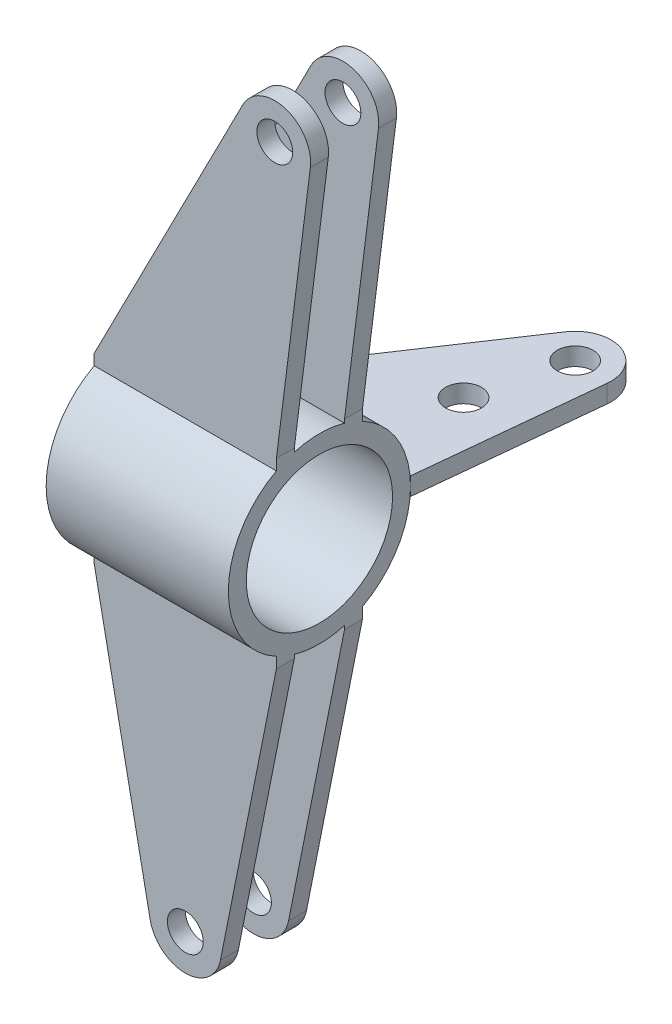
ISO-10303-21;
HEADER;
FILE_DESCRIPTION(('STEP AP214'),'2;1');
FILE_NAME('part.step','',(''),(''),'','','');
FILE_SCHEMA(('AUTOMOTIVE_DESIGN { 1 0 10303 214 1 1 1 1 }'));
ENDSEC;
DATA;
#1=APPLICATION_CONTEXT('core data for automotive mechanical design processes');
#2=APPLICATION_PROTOCOL_DEFINITION('international standard','automotive_design',2000,#1);
#3=PRODUCT_CONTEXT('',#1,'mechanical');
#4=PRODUCT('Part','Part','',(#3));
#5=PRODUCT_RELATED_PRODUCT_CATEGORY('part','',(#4));
#6=PRODUCT_DEFINITION_FORMATION('','',#4);
#7=PRODUCT_DEFINITION_CONTEXT('part definition',#1,'design');
#8=PRODUCT_DEFINITION('design','',#6,#7);
#9=PRODUCT_DEFINITION_SHAPE('','',#8);
#10=(LENGTH_UNIT() NAMED_UNIT(*) SI_UNIT(.MILLI.,.METRE.));
#11=(NAMED_UNIT(*) PLANE_ANGLE_UNIT() SI_UNIT($,.RADIAN.));
#12=(NAMED_UNIT(*) SI_UNIT($,.STERADIAN.) SOLID_ANGLE_UNIT());
#13=UNCERTAINTY_MEASURE_WITH_UNIT(LENGTH_MEASURE(1.E-05),#10,'distance_accuracy_value','');
#14=(GEOMETRIC_REPRESENTATION_CONTEXT(3) GLOBAL_UNCERTAINTY_ASSIGNED_CONTEXT((#13)) GLOBAL_UNIT_ASSIGNED_CONTEXT((#10,
#11,#12)) REPRESENTATION_CONTEXT('',''));
#15=CARTESIAN_POINT('',(0.,0.,0.));
#16=DIRECTION('',(0.,0.,1.));
#17=DIRECTION('',(1.,0.,0.));
#18=AXIS2_PLACEMENT_3D('',#15,#16,#17);
#19=CARTESIAN_POINT('',(20.5175410322133,2.5,-76.2));
#20=DIRECTION('',(0.,1.,0.));
#21=DIRECTION('',(0.,0.,1.));
#22=AXIS2_PLACEMENT_3D('',#19,#20,#21);
#23=PLANE('',#22);
#24=CARTESIAN_POINT('',(20.5175410322133,2.5,-76.2));
#25=DIRECTION('',(0.,1.,0.));
#26=DIRECTION('',(0.,0.,1.));
#27=AXIS2_PLACEMENT_3D('',#24,#25,#26);
#28=CIRCLE('',#27,5.);
#29=CARTESIAN_POINT('',(20.5175410322133,2.5,-71.2));
#30=VERTEX_POINT('',#29);
#31=EDGE_CURVE('E116',#30,#30,#28,.T.);
#32=ORIENTED_EDGE('',*,*,#31,.F.);
#33=EDGE_LOOP('',(#32));
#34=FACE_BOUND('',#33,.T.);
#35=DIRECTION('',(1.,0.,0.));
#36=VECTOR('',#35,1.);
#37=CARTESIAN_POINT('',(-25.4,2.5,-25.4));
#38=LINE('',#37,#36);
#39=CARTESIAN_POINT('',(-25.4,2.5,-25.4));
#40=VERTEX_POINT('',#39);
#41=CARTESIAN_POINT('',(25.4,2.5,-25.4));
#42=VERTEX_POINT('',#41);
#43=EDGE_CURVE('E101',#40,#42,#38,.T.);
#44=ORIENTED_EDGE('',*,*,#43,.T.);
#45=DIRECTION('',(0.101232743019742,0.,-0.994862770305884));
#46=VECTOR('',#45,1.);
#47=CARTESIAN_POINT('',(30.4661687352721,2.5,-75.1876725698026));
#48=LINE('',#47,#46);
#49=CARTESIAN_POINT('',(30.4661687352721,2.5,-75.1876725698026));
#50=VERTEX_POINT('',#49);
#51=EDGE_CURVE('E96',#42,#50,#48,.T.);
#52=ORIENTED_EDGE('',*,*,#51,.T.);
#53=CARTESIAN_POINT('',(20.5175410322133,2.5,-76.2));
#54=DIRECTION('',(0.,1.,0.));
#55=DIRECTION('',(0.,0.,1.));
#56=AXIS2_PLACEMENT_3D('',#53,#54,#55);
#57=CIRCLE('',#56,10.);
#58=CARTESIAN_POINT('',(12.1992442257602,2.5,-81.7503097426858));
#59=VERTEX_POINT('',#58);
#60=EDGE_CURVE('E99',#50,#59,#57,.T.);
#61=ORIENTED_EDGE('',*,*,#60,.T.);
#62=DIRECTION('',(-0.555030974268578,0.,0.831829680645307));
#63=VECTOR('',#62,1.);
#64=CARTESIAN_POINT('',(-25.4,2.5,-25.4));
#65=LINE('',#64,#63);
#66=EDGE_CURVE('E66',#59,#40,#65,.T.);
#67=ORIENTED_EDGE('',*,*,#66,.T.);
#68=EDGE_LOOP('',(#44,#52,#61,#67));
#69=FACE_BOUND('',#68,.T.);
#70=CARTESIAN_POINT('',(13.913567634422,2.5,-51.6735339814056));
#71=DIRECTION('',(0.,1.,0.));
#72=DIRECTION('',(0.,0.,1.));
#73=AXIS2_PLACEMENT_3D('',#70,#71,#72);
#74=CIRCLE('',#73,5.);
#75=CARTESIAN_POINT('',(13.913567634422,2.5,-46.6735339814056));
#76=VERTEX_POINT('',#75);
#77=EDGE_CURVE('E131',#76,#76,#74,.T.);
#78=ORIENTED_EDGE('',*,*,#77,.F.);
#79=EDGE_LOOP('',(#78));
#80=FACE_BOUND('',#79,.T.);
#81=ADVANCED_FACE('F49',(#34,#69,#80),#23,.T.);
#82=CARTESIAN_POINT('',(20.5175410322133,-2.5,-76.2));
#83=DIRECTION('',(0.,1.,0.));
#84=DIRECTION('',(0.,0.,1.));
#85=AXIS2_PLACEMENT_3D('',#82,#83,#84);
#86=PLANE('',#85);
#87=DIRECTION('',(1.,0.,0.));
#88=VECTOR('',#87,1.);
#89=CARTESIAN_POINT('',(-25.4,-2.5,-25.4));
#90=LINE('',#89,#88);
#91=CARTESIAN_POINT('',(-25.4,-2.5,-25.4));
#92=VERTEX_POINT('',#91);
#93=CARTESIAN_POINT('',(25.4,-2.5,-25.4));
#94=VERTEX_POINT('',#93);
#95=EDGE_CURVE('E113',#92,#94,#90,.T.);
#96=ORIENTED_EDGE('',*,*,#95,.F.);
#97=DIRECTION('',(-0.555030974268578,0.,0.831829680645307));
#98=VECTOR('',#97,1.);
#99=CARTESIAN_POINT('',(-25.4,-2.5,-25.4));
#100=LINE('',#99,#98);
#101=CARTESIAN_POINT('',(12.1992442257602,-2.5,-81.7503097426858));
#102=VERTEX_POINT('',#101);
#103=EDGE_CURVE('E89',#102,#92,#100,.T.);
#104=ORIENTED_EDGE('',*,*,#103,.F.);
#105=CARTESIAN_POINT('',(20.5175410322133,-2.5,-76.2));
#106=DIRECTION('',(0.,1.,0.));
#107=DIRECTION('',(0.,0.,1.));
#108=AXIS2_PLACEMENT_3D('',#105,#106,#107);
#109=CIRCLE('',#108,10.);
#110=CARTESIAN_POINT('',(30.4661687352721,-2.5,-75.1876725698026));
#111=VERTEX_POINT('',#110);
#112=EDGE_CURVE('E83',#111,#102,#109,.T.);
#113=ORIENTED_EDGE('',*,*,#112,.F.);
#114=DIRECTION('',(0.101232743019742,0.,-0.994862770305884));
#115=VECTOR('',#114,1.);
#116=CARTESIAN_POINT('',(30.4661687352721,-2.5,-75.1876725698026));
#117=LINE('',#116,#115);
#118=EDGE_CURVE('E105',#94,#111,#117,.T.);
#119=ORIENTED_EDGE('',*,*,#118,.F.);
#120=EDGE_LOOP('',(#96,#104,#113,#119));
#121=FACE_BOUND('',#120,.T.);
#122=CARTESIAN_POINT('',(20.5175410322133,-2.5,-76.2));
#123=DIRECTION('',(0.,1.,0.));
#124=DIRECTION('',(0.,0.,1.));
#125=AXIS2_PLACEMENT_3D('',#122,#123,#124);
#126=CIRCLE('',#125,5.);
#127=CARTESIAN_POINT('',(20.5175410322133,-2.5,-71.2));
#128=VERTEX_POINT('',#127);
#129=EDGE_CURVE('E128',#128,#128,#126,.T.);
#130=ORIENTED_EDGE('',*,*,#129,.T.);
#131=EDGE_LOOP('',(#130));
#132=FACE_BOUND('',#131,.T.);
#133=CARTESIAN_POINT('',(13.913567634422,-2.5,-51.6735339814056));
#134=DIRECTION('',(0.,1.,0.));
#135=DIRECTION('',(0.,0.,1.));
#136=AXIS2_PLACEMENT_3D('',#133,#134,#135);
#137=CIRCLE('',#136,5.);
#138=CARTESIAN_POINT('',(13.913567634422,-2.5,-46.6735339814056));
#139=VERTEX_POINT('',#138);
#140=EDGE_CURVE('E134',#139,#139,#137,.T.);
#141=ORIENTED_EDGE('',*,*,#140,.T.);
#142=EDGE_LOOP('',(#141));
#143=FACE_BOUND('',#142,.T.);
#144=ADVANCED_FACE('F124',(#121,#132,#143),#86,.F.);
#145=CARTESIAN_POINT('',(-25.4,2.5,-25.4));
#146=DIRECTION('',(0.,0.,-1.));
#147=DIRECTION('',(-1.,0.,0.));
#148=AXIS2_PLACEMENT_3D('',#145,#146,#147);
#149=PLANE('',#148);
#150=ORIENTED_EDGE('',*,*,#95,.T.);
#151=DIRECTION('',(0.,-1.,0.));
#152=VECTOR('',#151,1.);
#153=CARTESIAN_POINT('',(25.4,2.5,-25.4));
#154=LINE('',#153,#152);
#155=EDGE_CURVE('E12',#42,#94,#154,.T.);
#156=ORIENTED_EDGE('',*,*,#155,.F.);
#157=ORIENTED_EDGE('',*,*,#43,.F.);
#158=DIRECTION('',(0.,-1.,0.));
#159=VECTOR('',#158,1.);
#160=CARTESIAN_POINT('',(-25.4,2.5,-25.4));
#161=LINE('',#160,#159);
#162=EDGE_CURVE('E109',#40,#92,#161,.T.);
#163=ORIENTED_EDGE('',*,*,#162,.T.);
#164=EDGE_LOOP('',(#150,#156,#157,#163));
#165=FACE_BOUND('',#164,.T.);
#166=ADVANCED_FACE('F51',(#165),#149,.F.);
#167=CARTESIAN_POINT('',(30.4661687352721,2.5,-75.1876725698026));
#168=DIRECTION('',(-0.994862770305885,0.,-0.101232743019742));
#169=DIRECTION('',(-0.101232743019742,0.,0.994862770305885));
#170=AXIS2_PLACEMENT_3D('',#167,#168,#169);
#171=PLANE('',#170);
#172=ORIENTED_EDGE('',*,*,#118,.T.);
#173=DIRECTION('',(0.,-1.,0.));
#174=VECTOR('',#173,1.);
#175=CARTESIAN_POINT('',(30.4661687352721,2.5,-75.1876725698026));
#176=LINE('',#175,#174);
#177=EDGE_CURVE('E58',#50,#111,#176,.T.);
#178=ORIENTED_EDGE('',*,*,#177,.F.);
#179=ORIENTED_EDGE('',*,*,#51,.F.);
#180=ORIENTED_EDGE('',*,*,#155,.T.);
#181=EDGE_LOOP('',(#172,#178,#179,#180));
#182=FACE_BOUND('',#181,.T.);
#183=ADVANCED_FACE('F104',(#182),#171,.F.);
#184=CARTESIAN_POINT('',(20.5175410322133,2.5,-76.2));
#185=DIRECTION('',(0.,-1.,0.));
#186=DIRECTION('',(0.,0.,-1.));
#187=AXIS2_PLACEMENT_3D('',#184,#185,#186);
#188=CYLINDRICAL_SURFACE('',#187,10.);
#189=ORIENTED_EDGE('',*,*,#112,.T.);
#190=DIRECTION('',(0.,-1.,0.));
#191=VECTOR('',#190,1.);
#192=CARTESIAN_POINT('',(12.1992442257602,2.5,-81.7503097426858));
#193=LINE('',#192,#191);
#194=EDGE_CURVE('E106',#59,#102,#193,.T.);
#195=ORIENTED_EDGE('',*,*,#194,.F.);
#196=ORIENTED_EDGE('',*,*,#60,.F.);
#197=ORIENTED_EDGE('',*,*,#177,.T.);
#198=EDGE_LOOP('',(#189,#195,#196,#197));
#199=FACE_BOUND('',#198,.T.);
#200=ADVANCED_FACE('F107',(#199),#188,.T.);
#201=CARTESIAN_POINT('',(-25.4,2.5,-25.4));
#202=DIRECTION('',(0.831829680645307,0.,0.555030974268578));
#203=DIRECTION('',(0.555030974268578,0.,-0.831829680645307));
#204=AXIS2_PLACEMENT_3D('',#201,#202,#203);
#205=PLANE('',#204);
#206=ORIENTED_EDGE('',*,*,#103,.T.);
#207=ORIENTED_EDGE('',*,*,#162,.F.);
#208=ORIENTED_EDGE('',*,*,#66,.F.);
#209=ORIENTED_EDGE('',*,*,#194,.T.);
#210=EDGE_LOOP('',(#206,#207,#208,#209));
#211=FACE_BOUND('',#210,.T.);
#212=ADVANCED_FACE('F121',(#211),#205,.F.);
#213=CARTESIAN_POINT('',(20.5175410322133,2.5,-76.2));
#214=DIRECTION('',(0.,-1.,0.));
#215=DIRECTION('',(0.,0.,-1.));
#216=AXIS2_PLACEMENT_3D('',#213,#214,#215);
#217=CYLINDRICAL_SURFACE('',#216,5.);
#218=ORIENTED_EDGE('',*,*,#31,.T.);
#219=EDGE_LOOP('',(#218));
#220=FACE_BOUND('',#219,.T.);
#221=ORIENTED_EDGE('',*,*,#129,.F.);
#222=EDGE_LOOP('',(#221));
#223=FACE_BOUND('',#222,.T.);
#224=ADVANCED_FACE('F151',(#220,#223),#217,.F.);
#225=CARTESIAN_POINT('',(13.913567634422,2.5,-51.6735339814056));
#226=DIRECTION('',(0.,-1.,0.));
#227=DIRECTION('',(0.,0.,-1.));
#228=AXIS2_PLACEMENT_3D('',#225,#226,#227);
#229=CYLINDRICAL_SURFACE('',#228,5.);
#230=ORIENTED_EDGE('',*,*,#77,.T.);
#231=EDGE_LOOP('',(#230));
#232=FACE_BOUND('',#231,.T.);
#233=ORIENTED_EDGE('',*,*,#140,.F.);
#234=EDGE_LOOP('',(#233));
#235=FACE_BOUND('',#234,.T.);
#236=ADVANCED_FACE('F140',(#232,#235),#229,.F.);
#237=CLOSED_SHELL('',(#81,#144,#166,#183,#200,#212,#224,#236));
#238=MANIFOLD_SOLID_BREP('B2',#237);
#239=CARTESIAN_POINT('',(25.4,0.,0.));
#240=DIRECTION('',(-1.,0.,0.));
#241=DIRECTION('',(0.,0.,1.));
#242=AXIS2_PLACEMENT_3D('',#239,#240,#241);
#243=CYLINDRICAL_SURFACE('',#242,25.4);
#244=DIRECTION('',(-1.,0.,0.));
#245=VECTOR('',#244,1.);
#246=CARTESIAN_POINT('',(25.4,22.3866031366976,12.));
#247=LINE('',#246,#245);
#248=CARTESIAN_POINT('',(25.4,22.3866031366976,12.));
#249=VERTEX_POINT('',#248);
#250=CARTESIAN_POINT('',(-25.4,22.3866031366976,12.));
#251=VERTEX_POINT('',#250);
#252=EDGE_CURVE('E446',#249,#251,#247,.T.);
#253=ORIENTED_EDGE('',*,*,#252,.T.);
#254=CARTESIAN_POINT('',(-25.4,0.,0.));
#255=DIRECTION('',(1.,0.,0.));
#256=DIRECTION('',(0.,0.,-1.));
#257=AXIS2_PLACEMENT_3D('',#254,#255,#256);
#258=CIRCLE('',#257,25.4);
#259=CARTESIAN_POINT('',(-25.4,-22.3866031366976,12.));
#260=VERTEX_POINT('',#259);
#261=EDGE_CURVE('E655',#251,#260,#258,.T.);
#262=ORIENTED_EDGE('',*,*,#261,.T.);
#263=DIRECTION('',(-1.,0.,0.));
#264=VECTOR('',#263,1.);
#265=CARTESIAN_POINT('',(25.4,-22.3866031366976,12.));
#266=LINE('',#265,#264);
#267=CARTESIAN_POINT('',(25.4,-22.3866031366976,12.));
#268=VERTEX_POINT('',#267);
#269=EDGE_CURVE('E633',#268,#260,#266,.T.);
#270=ORIENTED_EDGE('',*,*,#269,.F.);
#271=CARTESIAN_POINT('',(25.4,0.,0.));
#272=DIRECTION('',(1.,0.,0.));
#273=DIRECTION('',(0.,0.,-1.));
#274=AXIS2_PLACEMENT_3D('',#271,#272,#273);
#275=CIRCLE('',#274,25.4);
#276=EDGE_CURVE('E226',#249,#268,#275,.T.);
#277=ORIENTED_EDGE('',*,*,#276,.F.);
#278=EDGE_LOOP('',(#253,#262,#270,#277));
#279=FACE_BOUND('',#278,.T.);
#280=ADVANCED_FACE('F215',(#279),#243,.T.);
#281=DIRECTION('',(-1.,0.,0.));
#282=VECTOR('',#281,1.);
#283=CARTESIAN_POINT('',(25.4,24.416387939251,7.));
#284=LINE('',#283,#282);
#285=CARTESIAN_POINT('',(25.4,24.416387939251,7.));
#286=VERTEX_POINT('',#285);
#287=CARTESIAN_POINT('',(-25.4,24.416387939251,7.));
#288=VERTEX_POINT('',#287);
#289=EDGE_CURVE('E240',#286,#288,#284,.T.);
#290=ORIENTED_EDGE('',*,*,#289,.F.);
#291=CARTESIAN_POINT('',(25.4,24.416387939251,-7.));
#292=VERTEX_POINT('',#291);
#293=EDGE_CURVE('E704',#292,#286,#275,.T.);
#294=ORIENTED_EDGE('',*,*,#293,.F.);
#295=DIRECTION('',(-1.,0.,0.));
#296=VECTOR('',#295,1.);
#297=CARTESIAN_POINT('',(25.4,24.416387939251,-7.));
#298=LINE('',#297,#296);
#299=CARTESIAN_POINT('',(-25.4,24.416387939251,-7.));
#300=VERTEX_POINT('',#299);
#301=EDGE_CURVE('E513',#292,#300,#298,.T.);
#302=ORIENTED_EDGE('',*,*,#301,.T.);
#303=EDGE_CURVE('E710',#300,#288,#258,.T.);
#304=ORIENTED_EDGE('',*,*,#303,.T.);
#305=EDGE_LOOP('',(#290,#294,#302,#304));
#306=FACE_BOUND('',#305,.T.);
#307=ADVANCED_FACE('F678',(#306),#243,.T.);
#308=DIRECTION('',(-1.,0.,0.));
#309=VECTOR('',#308,1.);
#310=CARTESIAN_POINT('',(25.4,22.3866031366976,-12.));
#311=LINE('',#310,#309);
#312=CARTESIAN_POINT('',(25.4,22.3866031366976,-12.));
#313=VERTEX_POINT('',#312);
#314=CARTESIAN_POINT('',(-25.4,22.3866031366976,-12.));
#315=VERTEX_POINT('',#314);
#316=EDGE_CURVE('E499',#313,#315,#311,.T.);
#317=ORIENTED_EDGE('',*,*,#316,.F.);
#318=CARTESIAN_POINT('',(25.4,-22.3866031366976,-12.));
#319=VERTEX_POINT('',#318);
#320=EDGE_CURVE('E225',#319,#313,#275,.T.);
#321=ORIENTED_EDGE('',*,*,#320,.F.);
#322=DIRECTION('',(-1.,0.,0.));
#323=VECTOR('',#322,1.);
#324=CARTESIAN_POINT('',(25.4,-22.3866031366976,-12.));
#325=LINE('',#324,#323);
#326=CARTESIAN_POINT('',(-25.4,-22.3866031366976,-12.));
#327=VERTEX_POINT('',#326);
#328=EDGE_CURVE('E581',#319,#327,#325,.T.);
#329=ORIENTED_EDGE('',*,*,#328,.T.);
#330=EDGE_CURVE('E691',#327,#315,#258,.T.);
#331=ORIENTED_EDGE('',*,*,#330,.T.);
#332=EDGE_LOOP('',(#317,#321,#329,#331));
#333=FACE_BOUND('',#332,.T.);
#334=ADVANCED_FACE('F217',(#333),#243,.T.);
#335=DIRECTION('',(-1.,0.,0.));
#336=VECTOR('',#335,1.);
#337=CARTESIAN_POINT('',(25.4,-24.416387939251,-7.));
#338=LINE('',#337,#336);
#339=CARTESIAN_POINT('',(25.4,-24.416387939251,-7.));
#340=VERTEX_POINT('',#339);
#341=CARTESIAN_POINT('',(-25.4,-24.416387939251,-7.));
#342=VERTEX_POINT('',#341);
#343=EDGE_CURVE('E567',#340,#342,#338,.T.);
#344=ORIENTED_EDGE('',*,*,#343,.F.);
#345=CARTESIAN_POINT('',(25.4,-24.416387939251,7.));
#346=VERTEX_POINT('',#345);
#347=EDGE_CURVE('E47',#346,#340,#275,.T.);
#348=ORIENTED_EDGE('',*,*,#347,.F.);
#349=DIRECTION('',(-1.,0.,0.));
#350=VECTOR('',#349,1.);
#351=CARTESIAN_POINT('',(25.4,-24.416387939251,7.));
#352=LINE('',#351,#350);
#353=CARTESIAN_POINT('',(-25.4,-24.416387939251,7.));
#354=VERTEX_POINT('',#353);
#355=EDGE_CURVE('E646',#346,#354,#352,.T.);
#356=ORIENTED_EDGE('',*,*,#355,.T.);
#357=EDGE_CURVE('E219',#354,#342,#258,.T.);
#358=ORIENTED_EDGE('',*,*,#357,.T.);
#359=EDGE_LOOP('',(#344,#348,#356,#358));
#360=FACE_BOUND('',#359,.T.);
#361=ADVANCED_FACE('F682',(#360),#243,.T.);
#362=CARTESIAN_POINT('',(25.4,0.,0.));
#363=DIRECTION('',(1.,0.,0.));
#364=DIRECTION('',(0.,0.,-1.));
#365=AXIS2_PLACEMENT_3D('',#362,#363,#364);
#366=PLANE('',#365);
#367=ORIENTED_EDGE('',*,*,#347,.T.);
#368=DIRECTION('',(0.,-1.,0.));
#369=VECTOR('',#368,1.);
#370=CARTESIAN_POINT('',(25.4,-25.4,-7.));
#371=LINE('',#370,#369);
#372=CARTESIAN_POINT('',(25.4,-25.4,-7.));
#373=VERTEX_POINT('',#372);
#374=EDGE_CURVE('E560',#340,#373,#371,.T.);
#375=ORIENTED_EDGE('',*,*,#374,.T.);
#376=DIRECTION('',(0.,0.,-1.));
#377=VECTOR('',#376,1.);
#378=CARTESIAN_POINT('',(25.4,-25.4,-12.));
#379=LINE('',#378,#377);
#380=CARTESIAN_POINT('',(25.4,-25.4,-12.));
#381=VERTEX_POINT('',#380);
#382=EDGE_CURVE('E564',#373,#381,#379,.T.);
#383=ORIENTED_EDGE('',*,*,#382,.T.);
#384=DIRECTION('',(0.,1.,0.));
#385=VECTOR('',#384,1.);
#386=CARTESIAN_POINT('',(25.4,-25.4,-12.));
#387=LINE('',#386,#385);
#388=EDGE_CURVE('E556',#381,#319,#387,.T.);
#389=ORIENTED_EDGE('',*,*,#388,.T.);
#390=ORIENTED_EDGE('',*,*,#320,.T.);
#391=DIRECTION('',(0.,1.,0.));
#392=VECTOR('',#391,1.);
#393=CARTESIAN_POINT('',(25.4,25.4,-12.));
#394=LINE('',#393,#392);
#395=CARTESIAN_POINT('',(25.4,25.4,-12.));
#396=VERTEX_POINT('',#395);
#397=EDGE_CURVE('E486',#313,#396,#394,.T.);
#398=ORIENTED_EDGE('',*,*,#397,.T.);
#399=DIRECTION('',(0.,0.,1.));
#400=VECTOR('',#399,1.);
#401=CARTESIAN_POINT('',(25.4,25.4,-12.));
#402=LINE('',#401,#400);
#403=CARTESIAN_POINT('',(25.4,25.4,-7.));
#404=VERTEX_POINT('',#403);
#405=EDGE_CURVE('E490',#396,#404,#402,.T.);
#406=ORIENTED_EDGE('',*,*,#405,.T.);
#407=DIRECTION('',(0.,-1.,0.));
#408=VECTOR('',#407,1.);
#409=CARTESIAN_POINT('',(25.4,25.4,-7.));
#410=LINE('',#409,#408);
#411=EDGE_CURVE('E495',#404,#292,#410,.T.);
#412=ORIENTED_EDGE('',*,*,#411,.T.);
#413=ORIENTED_EDGE('',*,*,#293,.T.);
#414=DIRECTION('',(0.,1.,0.));
#415=VECTOR('',#414,1.);
#416=CARTESIAN_POINT('',(25.4,25.4,7.));
#417=LINE('',#416,#415);
#418=CARTESIAN_POINT('',(25.4,25.4,7.));
#419=VERTEX_POINT('',#418);
#420=EDGE_CURVE('E429',#286,#419,#417,.T.);
#421=ORIENTED_EDGE('',*,*,#420,.T.);
#422=DIRECTION('',(0.,0.,1.));
#423=VECTOR('',#422,1.);
#424=CARTESIAN_POINT('',(25.4,25.4,12.));
#425=LINE('',#424,#423);
#426=CARTESIAN_POINT('',(25.4,25.4,12.));
#427=VERTEX_POINT('',#426);
#428=EDGE_CURVE('E433',#419,#427,#425,.T.);
#429=ORIENTED_EDGE('',*,*,#428,.T.);
#430=DIRECTION('',(0.,-1.,0.));
#431=VECTOR('',#430,1.);
#432=CARTESIAN_POINT('',(25.4,25.4,12.));
#433=LINE('',#432,#431);
#434=EDGE_CURVE('E389',#427,#249,#433,.T.);
#435=ORIENTED_EDGE('',*,*,#434,.T.);
#436=ORIENTED_EDGE('',*,*,#276,.T.);
#437=DIRECTION('',(0.,-1.,0.));
#438=VECTOR('',#437,1.);
#439=CARTESIAN_POINT('',(25.4,-25.4,12.));
#440=LINE('',#439,#438);
#441=CARTESIAN_POINT('',(25.4,-25.4,12.));
#442=VERTEX_POINT('',#441);
#443=EDGE_CURVE('E620',#268,#442,#440,.T.);
#444=ORIENTED_EDGE('',*,*,#443,.T.);
#445=DIRECTION('',(0.,0.,-1.));
#446=VECTOR('',#445,1.);
#447=CARTESIAN_POINT('',(25.4,-25.4,12.));
#448=LINE('',#447,#446);
#449=CARTESIAN_POINT('',(25.4,-25.4,7.));
#450=VERTEX_POINT('',#449);
#451=EDGE_CURVE('E624',#442,#450,#448,.T.);
#452=ORIENTED_EDGE('',*,*,#451,.T.);
#453=DIRECTION('',(0.,1.,0.));
#454=VECTOR('',#453,1.);
#455=CARTESIAN_POINT('',(25.4,-25.4,7.));
#456=LINE('',#455,#454);
#457=EDGE_CURVE('E629',#450,#346,#456,.T.);
#458=ORIENTED_EDGE('',*,*,#457,.T.);
#459=EDGE_LOOP('',(#367,#375,#383,#389,#390,#398,#406,#412,#413,#421,#429,#435,#436,#444,#452,#458));
#460=FACE_BOUND('',#459,.T.);
#461=CARTESIAN_POINT('',(25.4,0.,0.));
#462=DIRECTION('',(1.,0.,0.));
#463=DIRECTION('',(0.,0.,-1.));
#464=AXIS2_PLACEMENT_3D('',#461,#462,#463);
#465=CIRCLE('',#464,20.4);
#466=CARTESIAN_POINT('',(25.4,0.,-20.4));
#467=VERTEX_POINT('',#466);
#468=EDGE_CURVE('E651',#467,#467,#465,.T.);
#469=ORIENTED_EDGE('',*,*,#468,.F.);
#470=EDGE_LOOP('',(#469));
#471=FACE_BOUND('',#470,.T.);
#472=ADVANCED_FACE('F674',(#460,#471),#366,.T.);
#473=CARTESIAN_POINT('',(-25.4,0.,0.));
#474=DIRECTION('',(1.,0.,0.));
#475=DIRECTION('',(0.,0.,-1.));
#476=AXIS2_PLACEMENT_3D('',#473,#474,#475);
#477=PLANE('',#476);
#478=ORIENTED_EDGE('',*,*,#357,.F.);
#479=DIRECTION('',(0.,1.,0.));
#480=VECTOR('',#479,1.);
#481=CARTESIAN_POINT('',(-25.4,-25.4,7.));
#482=LINE('',#481,#480);
#483=CARTESIAN_POINT('',(-25.4,-25.4,7.));
#484=VERTEX_POINT('',#483);
#485=EDGE_CURVE('E625',#484,#354,#482,.T.);
#486=ORIENTED_EDGE('',*,*,#485,.F.);
#487=DIRECTION('',(0.,0.,-1.));
#488=VECTOR('',#487,1.);
#489=CARTESIAN_POINT('',(-25.4,-25.4,12.));
#490=LINE('',#489,#488);
#491=CARTESIAN_POINT('',(-25.4,-25.4,12.));
#492=VERTEX_POINT('',#491);
#493=EDGE_CURVE('E637',#492,#484,#490,.T.);
#494=ORIENTED_EDGE('',*,*,#493,.F.);
#495=DIRECTION('',(0.,-1.,0.));
#496=VECTOR('',#495,1.);
#497=CARTESIAN_POINT('',(-25.4,-25.4,12.));
#498=LINE('',#497,#496);
#499=EDGE_CURVE('E619',#260,#492,#498,.T.);
#500=ORIENTED_EDGE('',*,*,#499,.F.);
#501=ORIENTED_EDGE('',*,*,#261,.F.);
#502=DIRECTION('',(0.,-1.,0.));
#503=VECTOR('',#502,1.);
#504=CARTESIAN_POINT('',(-25.4,25.4,12.));
#505=LINE('',#504,#503);
#506=CARTESIAN_POINT('',(-25.4,25.4,12.));
#507=VERTEX_POINT('',#506);
#508=EDGE_CURVE('E403',#507,#251,#505,.T.);
#509=ORIENTED_EDGE('',*,*,#508,.F.);
#510=DIRECTION('',(0.,0.,1.));
#511=VECTOR('',#510,1.);
#512=CARTESIAN_POINT('',(-25.4,25.4,12.));
#513=LINE('',#512,#511);
#514=CARTESIAN_POINT('',(-25.4,25.4,7.));
#515=VERTEX_POINT('',#514);
#516=EDGE_CURVE('E430',#515,#507,#513,.T.);
#517=ORIENTED_EDGE('',*,*,#516,.F.);
#518=DIRECTION('',(0.,1.,0.));
#519=VECTOR('',#518,1.);
#520=CARTESIAN_POINT('',(-25.4,25.4,7.));
#521=LINE('',#520,#519);
#522=EDGE_CURVE('E438',#288,#515,#521,.T.);
#523=ORIENTED_EDGE('',*,*,#522,.F.);
#524=ORIENTED_EDGE('',*,*,#303,.F.);
#525=DIRECTION('',(0.,-1.,0.));
#526=VECTOR('',#525,1.);
#527=CARTESIAN_POINT('',(-25.4,25.4,-7.));
#528=LINE('',#527,#526);
#529=CARTESIAN_POINT('',(-25.4,25.4,-7.));
#530=VERTEX_POINT('',#529);
#531=EDGE_CURVE('E491',#530,#300,#528,.T.);
#532=ORIENTED_EDGE('',*,*,#531,.F.);
#533=DIRECTION('',(0.,0.,1.));
#534=VECTOR('',#533,1.);
#535=CARTESIAN_POINT('',(-25.4,25.4,-12.));
#536=LINE('',#535,#534);
#537=CARTESIAN_POINT('',(-25.4,25.4,-12.));
#538=VERTEX_POINT('',#537);
#539=EDGE_CURVE('E503',#538,#530,#536,.T.);
#540=ORIENTED_EDGE('',*,*,#539,.F.);
#541=DIRECTION('',(0.,1.,0.));
#542=VECTOR('',#541,1.);
#543=CARTESIAN_POINT('',(-25.4,25.4,-12.));
#544=LINE('',#543,#542);
#545=EDGE_CURVE('E483',#315,#538,#544,.T.);
#546=ORIENTED_EDGE('',*,*,#545,.F.);
#547=ORIENTED_EDGE('',*,*,#330,.F.);
#548=DIRECTION('',(0.,1.,0.));
#549=VECTOR('',#548,1.);
#550=CARTESIAN_POINT('',(-25.4,-25.4,-12.));
#551=LINE('',#550,#549);
#552=CARTESIAN_POINT('',(-25.4,-25.4,-12.));
#553=VERTEX_POINT('',#552);
#554=EDGE_CURVE('E553',#553,#327,#551,.T.);
#555=ORIENTED_EDGE('',*,*,#554,.F.);
#556=DIRECTION('',(0.,0.,-1.));
#557=VECTOR('',#556,1.);
#558=CARTESIAN_POINT('',(-25.4,-25.4,-12.));
#559=LINE('',#558,#557);
#560=CARTESIAN_POINT('',(-25.4,-25.4,-7.));
#561=VERTEX_POINT('',#560);
#562=EDGE_CURVE('E561',#561,#553,#559,.T.);
#563=ORIENTED_EDGE('',*,*,#562,.F.);
#564=DIRECTION('',(0.,-1.,0.));
#565=VECTOR('',#564,1.);
#566=CARTESIAN_POINT('',(-25.4,-25.4,-7.));
#567=LINE('',#566,#565);
#568=EDGE_CURVE('E571',#342,#561,#567,.T.);
#569=ORIENTED_EDGE('',*,*,#568,.F.);
#570=EDGE_LOOP('',(#478,#486,#494,#500,#501,#509,#517,#523,#524,#532,#540,#546,#547,#555,#563,#569));
#571=FACE_BOUND('',#570,.T.);
#572=CARTESIAN_POINT('',(-25.4,0.,0.));
#573=DIRECTION('',(1.,0.,0.));
#574=DIRECTION('',(0.,0.,-1.));
#575=AXIS2_PLACEMENT_3D('',#572,#573,#574);
#576=CIRCLE('',#575,20.4);
#577=CARTESIAN_POINT('',(-25.4,0.,-20.4));
#578=VERTEX_POINT('',#577);
#579=EDGE_CURVE('E650',#578,#578,#576,.T.);
#580=ORIENTED_EDGE('',*,*,#579,.T.);
#581=EDGE_LOOP('',(#580));
#582=FACE_BOUND('',#581,.T.);
#583=ADVANCED_FACE('F660',(#571,#582),#477,.F.);
#584=CARTESIAN_POINT('',(25.4,0.,0.));
#585=DIRECTION('',(-1.,0.,0.));
#586=DIRECTION('',(0.,0.,1.));
#587=AXIS2_PLACEMENT_3D('',#584,#585,#586);
#588=CYLINDRICAL_SURFACE('',#587,20.4);
#589=ORIENTED_EDGE('',*,*,#468,.T.);
#590=EDGE_LOOP('',(#589));
#591=FACE_BOUND('',#590,.T.);
#592=ORIENTED_EDGE('',*,*,#579,.F.);
#593=EDGE_LOOP('',(#592));
#594=FACE_BOUND('',#593,.T.);
#595=ADVANCED_FACE('F662',(#591,#594),#588,.F.);
#596=CARTESIAN_POINT('',(25.4,-25.4,12.));
#597=DIRECTION('',(0.,0.,-1.));
#598=DIRECTION('',(-1.,0.,0.));
#599=AXIS2_PLACEMENT_3D('',#596,#597,#598);
#600=PLANE('',#599);
#601=ORIENTED_EDGE('',*,*,#499,.T.);
#602=DIRECTION('',(0.195657188634298,-0.980672353304468,0.));
#603=VECTOR('',#602,1.);
#604=CARTESIAN_POINT('',(-25.4,-25.4,12.));
#605=LINE('',#604,#603);
#606=CARTESIAN_POINT('',(-9.80672353304464,-103.556571886343,12.));
#607=VERTEX_POINT('',#606);
#608=EDGE_CURVE('E594',#492,#607,#605,.T.);
#609=ORIENTED_EDGE('',*,*,#608,.T.);
#610=CARTESIAN_POINT('',(0.,-101.6,12.));
#611=DIRECTION('',(0.,0.,1.));
#612=DIRECTION('',(1.,0.,0.));
#613=AXIS2_PLACEMENT_3D('',#610,#611,#612);
#614=CIRCLE('',#613,10.);
#615=CARTESIAN_POINT('',(9.80672353304472,-103.556571886343,12.));
#616=VERTEX_POINT('',#615);
#617=EDGE_CURVE('E597',#607,#616,#614,.T.);
#618=ORIENTED_EDGE('',*,*,#617,.T.);
#619=DIRECTION('',(0.195657188634297,0.980672353304468,0.));
#620=VECTOR('',#619,1.);
#621=CARTESIAN_POINT('',(25.4,-25.4,12.));
#622=LINE('',#621,#620);
#623=EDGE_CURVE('E601',#616,#442,#622,.T.);
#624=ORIENTED_EDGE('',*,*,#623,.T.);
#625=ORIENTED_EDGE('',*,*,#443,.F.);
#626=ORIENTED_EDGE('',*,*,#269,.T.);
#627=EDGE_LOOP('',(#601,#609,#618,#624,#625,#626));
#628=FACE_BOUND('',#627,.T.);
#629=CARTESIAN_POINT('',(0.,-101.6,12.));
#630=DIRECTION('',(0.,0.,1.));
#631=DIRECTION('',(1.,0.,0.));
#632=AXIS2_PLACEMENT_3D('',#629,#630,#631);
#633=CIRCLE('',#632,5.);
#634=CARTESIAN_POINT('',(5.00000000000004,-101.6,12.));
#635=VERTEX_POINT('',#634);
#636=EDGE_CURVE('E586',#635,#635,#633,.T.);
#637=ORIENTED_EDGE('',*,*,#636,.F.);
#638=EDGE_LOOP('',(#637));
#639=FACE_BOUND('',#638,.T.);
#640=ADVANCED_FACE('F664',(#628,#639),#600,.F.);
#641=CARTESIAN_POINT('',(25.4,-25.4,7.));
#642=DIRECTION('',(0.,0.,1.));
#643=DIRECTION('',(1.,0.,0.));
#644=AXIS2_PLACEMENT_3D('',#641,#642,#643);
#645=PLANE('',#644);
#646=ORIENTED_EDGE('',*,*,#485,.T.);
#647=ORIENTED_EDGE('',*,*,#355,.F.);
#648=ORIENTED_EDGE('',*,*,#457,.F.);
#649=DIRECTION('',(0.195657188634297,0.980672353304468,0.));
#650=VECTOR('',#649,1.);
#651=CARTESIAN_POINT('',(25.4,-25.4,7.));
#652=LINE('',#651,#650);
#653=CARTESIAN_POINT('',(9.80672353304472,-103.556571886343,7.));
#654=VERTEX_POINT('',#653);
#655=EDGE_CURVE('E598',#654,#450,#652,.T.);
#656=ORIENTED_EDGE('',*,*,#655,.F.);
#657=CARTESIAN_POINT('',(0.,-101.6,7.));
#658=DIRECTION('',(0.,0.,1.));
#659=DIRECTION('',(1.,0.,0.));
#660=AXIS2_PLACEMENT_3D('',#657,#658,#659);
#661=CIRCLE('',#660,10.);
#662=CARTESIAN_POINT('',(-9.80672353304464,-103.556571886343,7.));
#663=VERTEX_POINT('',#662);
#664=EDGE_CURVE('E607',#663,#654,#661,.T.);
#665=ORIENTED_EDGE('',*,*,#664,.F.);
#666=DIRECTION('',(0.195657188634298,-0.980672353304468,0.));
#667=VECTOR('',#666,1.);
#668=CARTESIAN_POINT('',(-25.4,-25.4,7.));
#669=LINE('',#668,#667);
#670=EDGE_CURVE('E590',#484,#663,#669,.T.);
#671=ORIENTED_EDGE('',*,*,#670,.F.);
#672=EDGE_LOOP('',(#646,#647,#648,#656,#665,#671));
#673=FACE_BOUND('',#672,.T.);
#674=CARTESIAN_POINT('',(0.,-101.6,7.));
#675=DIRECTION('',(0.,0.,1.));
#676=DIRECTION('',(1.,0.,0.));
#677=AXIS2_PLACEMENT_3D('',#674,#675,#676);
#678=CIRCLE('',#677,5.);
#679=CARTESIAN_POINT('',(5.00000000000004,-101.6,7.));
#680=VERTEX_POINT('',#679);
#681=EDGE_CURVE('E585',#680,#680,#678,.T.);
#682=ORIENTED_EDGE('',*,*,#681,.T.);
#683=EDGE_LOOP('',(#682));
#684=FACE_BOUND('',#683,.T.);
#685=ADVANCED_FACE('F671',(#673,#684),#645,.F.);
#686=CARTESIAN_POINT('',(-25.4,-25.4,12.));
#687=DIRECTION('',(0.980672353304468,0.195657188634298,0.));
#688=DIRECTION('',(-0.195657188634298,0.980672353304468,0.));
#689=AXIS2_PLACEMENT_3D('',#686,#687,#688);
#690=PLANE('',#689);
#691=ORIENTED_EDGE('',*,*,#670,.T.);
#692=DIRECTION('',(0.,0.,-1.));
#693=VECTOR('',#692,1.);
#694=CARTESIAN_POINT('',(-9.80672353304464,-103.556571886343,12.));
#695=LINE('',#694,#693);
#696=EDGE_CURVE('E615',#607,#663,#695,.T.);
#697=ORIENTED_EDGE('',*,*,#696,.F.);
#698=ORIENTED_EDGE('',*,*,#608,.F.);
#699=ORIENTED_EDGE('',*,*,#493,.T.);
#700=EDGE_LOOP('',(#691,#697,#698,#699));
#701=FACE_BOUND('',#700,.T.);
#702=ADVANCED_FACE('F797',(#701),#690,.F.);
#703=CARTESIAN_POINT('',(0.,-101.6,12.));
#704=DIRECTION('',(0.,0.,-1.));
#705=DIRECTION('',(-1.,0.,0.));
#706=AXIS2_PLACEMENT_3D('',#703,#704,#705);
#707=CYLINDRICAL_SURFACE('',#706,10.);
#708=ORIENTED_EDGE('',*,*,#664,.T.);
#709=DIRECTION('',(0.,0.,-1.));
#710=VECTOR('',#709,1.);
#711=CARTESIAN_POINT('',(9.80672353304472,-103.556571886343,12.));
#712=LINE('',#711,#710);
#713=EDGE_CURVE('E604',#616,#654,#712,.T.);
#714=ORIENTED_EDGE('',*,*,#713,.F.);
#715=ORIENTED_EDGE('',*,*,#617,.F.);
#716=ORIENTED_EDGE('',*,*,#696,.T.);
#717=EDGE_LOOP('',(#708,#714,#715,#716));
#718=FACE_BOUND('',#717,.T.);
#719=ADVANCED_FACE('F793',(#718),#707,.T.);
#720=CARTESIAN_POINT('',(25.4,-25.4,12.));
#721=DIRECTION('',(-0.980672353304468,0.195657188634297,0.));
#722=DIRECTION('',(-0.195657188634297,-0.980672353304468,0.));
#723=AXIS2_PLACEMENT_3D('',#720,#721,#722);
#724=PLANE('',#723);
#725=ORIENTED_EDGE('',*,*,#655,.T.);
#726=ORIENTED_EDGE('',*,*,#451,.F.);
#727=ORIENTED_EDGE('',*,*,#623,.F.);
#728=ORIENTED_EDGE('',*,*,#713,.T.);
#729=EDGE_LOOP('',(#725,#726,#727,#728));
#730=FACE_BOUND('',#729,.T.);
#731=ADVANCED_FACE('F789',(#730),#724,.F.);
#732=CARTESIAN_POINT('',(0.,-101.6,12.));
#733=DIRECTION('',(0.,0.,-1.));
#734=DIRECTION('',(-1.,0.,0.));
#735=AXIS2_PLACEMENT_3D('',#732,#733,#734);
#736=CYLINDRICAL_SURFACE('',#735,5.);
#737=ORIENTED_EDGE('',*,*,#636,.T.);
#738=EDGE_LOOP('',(#737));
#739=FACE_BOUND('',#738,.T.);
#740=ORIENTED_EDGE('',*,*,#681,.F.);
#741=EDGE_LOOP('',(#740));
#742=FACE_BOUND('',#741,.T.);
#743=ADVANCED_FACE('F785',(#739,#742),#736,.F.);
#744=CARTESIAN_POINT('',(25.4,-25.4,-12.));
#745=DIRECTION('',(0.,0.,1.));
#746=DIRECTION('',(1.,0.,0.));
#747=AXIS2_PLACEMENT_3D('',#744,#745,#746);
#748=PLANE('',#747);
#749=ORIENTED_EDGE('',*,*,#554,.T.);
#750=ORIENTED_EDGE('',*,*,#328,.F.);
#751=ORIENTED_EDGE('',*,*,#388,.F.);
#752=DIRECTION('',(0.195657188634297,0.980672353304468,0.));
#753=VECTOR('',#752,1.);
#754=CARTESIAN_POINT('',(25.4,-25.4,-12.));
#755=LINE('',#754,#753);
#756=CARTESIAN_POINT('',(9.80672353304472,-103.556571886343,-12.));
#757=VERTEX_POINT('',#756);
#758=EDGE_CURVE('E535',#757,#381,#755,.T.);
#759=ORIENTED_EDGE('',*,*,#758,.F.);
#760=CARTESIAN_POINT('',(0.,-101.6,-12.));
#761=DIRECTION('',(0.,0.,1.));
#762=DIRECTION('',(1.,0.,0.));
#763=AXIS2_PLACEMENT_3D('',#760,#761,#762);
#764=CIRCLE('',#763,10.);
#765=CARTESIAN_POINT('',(-9.80672353304464,-103.556571886343,-12.));
#766=VERTEX_POINT('',#765);
#767=EDGE_CURVE('E530',#766,#757,#764,.T.);
#768=ORIENTED_EDGE('',*,*,#767,.F.);
#769=DIRECTION('',(0.195657188634298,-0.980672353304468,0.));
#770=VECTOR('',#769,1.);
#771=CARTESIAN_POINT('',(-25.4,-25.4,-12.));
#772=LINE('',#771,#770);
#773=EDGE_CURVE('E526',#553,#766,#772,.T.);
#774=ORIENTED_EDGE('',*,*,#773,.F.);
#775=EDGE_LOOP('',(#749,#750,#751,#759,#768,#774));
#776=FACE_BOUND('',#775,.T.);
#777=CARTESIAN_POINT('',(0.,-101.6,-12.));
#778=DIRECTION('',(0.,0.,1.));
#779=DIRECTION('',(1.,0.,0.));
#780=AXIS2_PLACEMENT_3D('',#777,#778,#779);
#781=CIRCLE('',#780,5.);
#782=CARTESIAN_POINT('',(5.00000000000004,-101.6,-12.));
#783=VERTEX_POINT('',#782);
#784=EDGE_CURVE('E518',#783,#783,#781,.T.);
#785=ORIENTED_EDGE('',*,*,#784,.T.);
#786=EDGE_LOOP('',(#785));
#787=FACE_BOUND('',#786,.T.);
#788=ADVANCED_FACE('F781',(#776,#787),#748,.F.);
#789=CARTESIAN_POINT('',(25.4,-25.4,-7.));
#790=DIRECTION('',(0.,0.,-1.));
#791=DIRECTION('',(-1.,0.,0.));
#792=AXIS2_PLACEMENT_3D('',#789,#790,#791);
#793=PLANE('',#792);
#794=ORIENTED_EDGE('',*,*,#568,.T.);
#795=DIRECTION('',(0.195657188634298,-0.980672353304468,0.));
#796=VECTOR('',#795,1.);
#797=CARTESIAN_POINT('',(-25.4,-25.4,-7.));
#798=LINE('',#797,#796);
#799=CARTESIAN_POINT('',(-9.80672353304464,-103.556571886343,-7.));
#800=VERTEX_POINT('',#799);
#801=EDGE_CURVE('E522',#561,#800,#798,.T.);
#802=ORIENTED_EDGE('',*,*,#801,.T.);
#803=CARTESIAN_POINT('',(0.,-101.6,-7.));
#804=DIRECTION('',(0.,0.,1.));
#805=DIRECTION('',(1.,0.,0.));
#806=AXIS2_PLACEMENT_3D('',#803,#804,#805);
#807=CIRCLE('',#806,10.);
#808=CARTESIAN_POINT('',(9.80672353304472,-103.556571886343,-7.));
#809=VERTEX_POINT('',#808);
#810=EDGE_CURVE('E543',#800,#809,#807,.T.);
#811=ORIENTED_EDGE('',*,*,#810,.T.);
#812=DIRECTION('',(0.195657188634297,0.980672353304468,0.));
#813=VECTOR('',#812,1.);
#814=CARTESIAN_POINT('',(25.4,-25.4,-7.));
#815=LINE('',#814,#813);
#816=EDGE_CURVE('E531',#809,#373,#815,.T.);
#817=ORIENTED_EDGE('',*,*,#816,.T.);
#818=ORIENTED_EDGE('',*,*,#374,.F.);
#819=ORIENTED_EDGE('',*,*,#343,.T.);
#820=EDGE_LOOP('',(#794,#802,#811,#817,#818,#819));
#821=FACE_BOUND('',#820,.T.);
#822=CARTESIAN_POINT('',(0.,-101.6,-7.));
#823=DIRECTION('',(0.,0.,1.));
#824=DIRECTION('',(1.,0.,0.));
#825=AXIS2_PLACEMENT_3D('',#822,#823,#824);
#826=CIRCLE('',#825,5.);
#827=CARTESIAN_POINT('',(5.00000000000004,-101.6,-7.));
#828=VERTEX_POINT('',#827);
#829=EDGE_CURVE('E517',#828,#828,#826,.T.);
#830=ORIENTED_EDGE('',*,*,#829,.F.);
#831=EDGE_LOOP('',(#830));
#832=FACE_BOUND('',#831,.T.);
#833=ADVANCED_FACE('F771',(#821,#832),#793,.F.);
#834=CARTESIAN_POINT('',(25.4,-25.4,-12.));
#835=DIRECTION('',(0.980672353304468,-0.195657188634297,0.));
#836=DIRECTION('',(0.195657188634297,0.980672353304468,0.));
#837=AXIS2_PLACEMENT_3D('',#834,#835,#836);
#838=PLANE('',#837);
#839=ORIENTED_EDGE('',*,*,#816,.F.);
#840=DIRECTION('',(0.,0.,1.));
#841=VECTOR('',#840,1.);
#842=CARTESIAN_POINT('',(9.80672353304472,-103.556571886343,-12.));
#843=LINE('',#842,#841);
#844=EDGE_CURVE('E550',#757,#809,#843,.T.);
#845=ORIENTED_EDGE('',*,*,#844,.F.);
#846=ORIENTED_EDGE('',*,*,#758,.T.);
#847=ORIENTED_EDGE('',*,*,#382,.F.);
#848=EDGE_LOOP('',(#839,#845,#846,#847));
#849=FACE_BOUND('',#848,.T.);
#850=ADVANCED_FACE('F767',(#849),#838,.T.);
#851=CARTESIAN_POINT('',(0.,-101.6,-12.));
#852=DIRECTION('',(0.,0.,1.));
#853=DIRECTION('',(1.,0.,0.));
#854=AXIS2_PLACEMENT_3D('',#851,#852,#853);
#855=CYLINDRICAL_SURFACE('',#854,10.);
#856=ORIENTED_EDGE('',*,*,#810,.F.);
#857=DIRECTION('',(0.,0.,1.));
#858=VECTOR('',#857,1.);
#859=CARTESIAN_POINT('',(-9.80672353304464,-103.556571886343,-12.));
#860=LINE('',#859,#858);
#861=EDGE_CURVE('E539',#766,#800,#860,.T.);
#862=ORIENTED_EDGE('',*,*,#861,.F.);
#863=ORIENTED_EDGE('',*,*,#767,.T.);
#864=ORIENTED_EDGE('',*,*,#844,.T.);
#865=EDGE_LOOP('',(#856,#862,#863,#864));
#866=FACE_BOUND('',#865,.T.);
#867=ADVANCED_FACE('F770',(#866),#855,.T.);
#868=CARTESIAN_POINT('',(-25.4,-25.4,-12.));
#869=DIRECTION('',(-0.980672353304468,-0.195657188634298,0.));
#870=DIRECTION('',(0.195657188634298,-0.980672353304468,0.));
#871=AXIS2_PLACEMENT_3D('',#868,#869,#870);
#872=PLANE('',#871);
#873=ORIENTED_EDGE('',*,*,#801,.F.);
#874=ORIENTED_EDGE('',*,*,#562,.T.);
#875=ORIENTED_EDGE('',*,*,#773,.T.);
#876=ORIENTED_EDGE('',*,*,#861,.T.);
#877=EDGE_LOOP('',(#873,#874,#875,#876));
#878=FACE_BOUND('',#877,.T.);
#879=ADVANCED_FACE('F765',(#878),#872,.T.);
#880=CARTESIAN_POINT('',(0.,-101.6,-12.));
#881=DIRECTION('',(0.,0.,1.));
#882=DIRECTION('',(1.,0.,0.));
#883=AXIS2_PLACEMENT_3D('',#880,#881,#882);
#884=CYLINDRICAL_SURFACE('',#883,5.);
#885=ORIENTED_EDGE('',*,*,#784,.F.);
#886=EDGE_LOOP('',(#885));
#887=FACE_BOUND('',#886,.T.);
#888=ORIENTED_EDGE('',*,*,#829,.T.);
#889=EDGE_LOOP('',(#888));
#890=FACE_BOUND('',#889,.T.);
#891=ADVANCED_FACE('F762',(#887,#890),#884,.F.);
#892=CARTESIAN_POINT('',(25.4,25.4,-12.));
#893=DIRECTION('',(0.,0.,1.));
#894=DIRECTION('',(1.,0.,0.));
#895=AXIS2_PLACEMENT_3D('',#892,#893,#894);
#896=PLANE('',#895);
#897=ORIENTED_EDGE('',*,*,#545,.T.);
#898=DIRECTION('',(-0.456618741492404,-0.889662478088119,0.));
#899=VECTOR('',#898,1.);
#900=CARTESIAN_POINT('',(-25.4,25.4,-12.));
#901=LINE('',#900,#899);
#902=CARTESIAN_POINT('',(16.0531979945876,106.166187414924,-12.));
#903=VERTEX_POINT('',#902);
#904=EDGE_CURVE('E467',#903,#538,#901,.T.);
#905=ORIENTED_EDGE('',*,*,#904,.F.);
#906=CARTESIAN_POINT('',(24.9498227754688,101.6,-12.));
#907=DIRECTION('',(0.,0.,1.));
#908=DIRECTION('',(1.,0.,0.));
#909=AXIS2_PLACEMENT_3D('',#906,#907,#908);
#910=CIRCLE('',#909,10.);
#911=CARTESIAN_POINT('',(34.8709203368117,100.346276275124,-12.));
#912=VERTEX_POINT('',#911);
#913=EDGE_CURVE('E462',#912,#903,#910,.T.);
#914=ORIENTED_EDGE('',*,*,#913,.F.);
#915=DIRECTION('',(0.125372372487574,0.992109756134288,0.));
#916=VECTOR('',#915,1.);
#917=CARTESIAN_POINT('',(25.4,25.4,-12.));
#918=LINE('',#917,#916);
#919=EDGE_CURVE('E458',#396,#912,#918,.T.);
#920=ORIENTED_EDGE('',*,*,#919,.F.);
#921=ORIENTED_EDGE('',*,*,#397,.F.);
#922=ORIENTED_EDGE('',*,*,#316,.T.);
#923=EDGE_LOOP('',(#897,#905,#914,#920,#921,#922));
#924=FACE_BOUND('',#923,.T.);
#925=CARTESIAN_POINT('',(24.9498227754688,101.6,-12.));
#926=DIRECTION('',(0.,0.,1.));
#927=DIRECTION('',(1.,0.,0.));
#928=AXIS2_PLACEMENT_3D('',#925,#926,#927);
#929=CIRCLE('',#928,5.);
#930=CARTESIAN_POINT('',(29.9498227754688,101.6,-12.));
#931=VERTEX_POINT('',#930);
#932=EDGE_CURVE('E450',#931,#931,#929,.T.);
#933=ORIENTED_EDGE('',*,*,#932,.T.);
#934=EDGE_LOOP('',(#933));
#935=FACE_BOUND('',#934,.T.);
#936=ADVANCED_FACE('F695',(#924,#935),#896,.F.);
#937=CARTESIAN_POINT('',(25.4,25.4,-7.));
#938=DIRECTION('',(0.,0.,-1.));
#939=DIRECTION('',(-1.,0.,0.));
#940=AXIS2_PLACEMENT_3D('',#937,#938,#939);
#941=PLANE('',#940);
#942=ORIENTED_EDGE('',*,*,#531,.T.);
#943=ORIENTED_EDGE('',*,*,#301,.F.);
#944=ORIENTED_EDGE('',*,*,#411,.F.);
#945=DIRECTION('',(0.125372372487574,0.992109756134288,0.));
#946=VECTOR('',#945,1.);
#947=CARTESIAN_POINT('',(25.4,25.4,-7.));
#948=LINE('',#947,#946);
#949=CARTESIAN_POINT('',(34.8709203368117,100.346276275124,-7.));
#950=VERTEX_POINT('',#949);
#951=EDGE_CURVE('E454',#404,#950,#948,.T.);
#952=ORIENTED_EDGE('',*,*,#951,.T.);
#953=CARTESIAN_POINT('',(24.9498227754688,101.6,-7.));
#954=DIRECTION('',(0.,0.,1.));
#955=DIRECTION('',(1.,0.,0.));
#956=AXIS2_PLACEMENT_3D('',#953,#954,#955);
#957=CIRCLE('',#956,10.);
#958=CARTESIAN_POINT('',(16.0531979945876,106.166187414924,-7.));
#959=VERTEX_POINT('',#958);
#960=EDGE_CURVE('E474',#950,#959,#957,.T.);
#961=ORIENTED_EDGE('',*,*,#960,.T.);
#962=DIRECTION('',(-0.456618741492404,-0.889662478088119,0.));
#963=VECTOR('',#962,1.);
#964=CARTESIAN_POINT('',(-25.4,25.4,-7.));
#965=LINE('',#964,#963);
#966=EDGE_CURVE('E463',#959,#530,#965,.T.);
#967=ORIENTED_EDGE('',*,*,#966,.T.);
#968=EDGE_LOOP('',(#942,#943,#944,#952,#961,#967));
#969=FACE_BOUND('',#968,.T.);
#970=CARTESIAN_POINT('',(24.9498227754688,101.6,-7.));
#971=DIRECTION('',(0.,0.,1.));
#972=DIRECTION('',(1.,0.,0.));
#973=AXIS2_PLACEMENT_3D('',#970,#971,#972);
#974=CIRCLE('',#973,5.);
#975=CARTESIAN_POINT('',(29.9498227754688,101.6,-7.));
#976=VERTEX_POINT('',#975);
#977=EDGE_CURVE('E449',#976,#976,#974,.T.);
#978=ORIENTED_EDGE('',*,*,#977,.F.);
#979=EDGE_LOOP('',(#978));
#980=FACE_BOUND('',#979,.T.);
#981=ADVANCED_FACE('F749',(#969,#980),#941,.F.);
#982=CARTESIAN_POINT('',(-25.4,25.4,-12.));
#983=DIRECTION('',(-0.889662478088119,0.456618741492404,0.));
#984=DIRECTION('',(-0.456618741492404,-0.889662478088119,0.));
#985=AXIS2_PLACEMENT_3D('',#982,#983,#984);
#986=PLANE('',#985);
#987=ORIENTED_EDGE('',*,*,#966,.F.);
#988=DIRECTION('',(0.,0.,1.));
#989=VECTOR('',#988,1.);
#990=CARTESIAN_POINT('',(16.0531979945876,106.166187414924,-12.));
#991=LINE('',#990,#989);
#992=EDGE_CURVE('E480',#903,#959,#991,.T.);
#993=ORIENTED_EDGE('',*,*,#992,.F.);
#994=ORIENTED_EDGE('',*,*,#904,.T.);
#995=ORIENTED_EDGE('',*,*,#539,.T.);
#996=EDGE_LOOP('',(#987,#993,#994,#995));
#997=FACE_BOUND('',#996,.T.);
#998=ADVANCED_FACE('F745',(#997),#986,.T.);
#999=CARTESIAN_POINT('',(24.9498227754688,101.6,-12.));
#1000=DIRECTION('',(0.,0.,1.));
#1001=DIRECTION('',(1.,0.,0.));
#1002=AXIS2_PLACEMENT_3D('',#999,#1000,#1001);
#1003=CYLINDRICAL_SURFACE('',#1002,10.);
#1004=ORIENTED_EDGE('',*,*,#960,.F.);
#1005=DIRECTION('',(0.,0.,1.));
#1006=VECTOR('',#1005,1.);
#1007=CARTESIAN_POINT('',(34.8709203368117,100.346276275124,-12.));
#1008=LINE('',#1007,#1006);
#1009=EDGE_CURVE('E470',#912,#950,#1008,.T.);
#1010=ORIENTED_EDGE('',*,*,#1009,.F.);
#1011=ORIENTED_EDGE('',*,*,#913,.T.);
#1012=ORIENTED_EDGE('',*,*,#992,.T.);
#1013=EDGE_LOOP('',(#1004,#1010,#1011,#1012));
#1014=FACE_BOUND('',#1013,.T.);
#1015=ADVANCED_FACE('F748',(#1014),#1003,.T.);
#1016=CARTESIAN_POINT('',(25.4,25.4,-12.));
#1017=DIRECTION('',(0.992109756134288,-0.125372372487574,0.));
#1018=DIRECTION('',(0.125372372487574,0.992109756134288,0.));
#1019=AXIS2_PLACEMENT_3D('',#1016,#1017,#1018);
#1020=PLANE('',#1019);
#1021=ORIENTED_EDGE('',*,*,#951,.F.);
#1022=ORIENTED_EDGE('',*,*,#405,.F.);
#1023=ORIENTED_EDGE('',*,*,#919,.T.);
#1024=ORIENTED_EDGE('',*,*,#1009,.T.);
#1025=EDGE_LOOP('',(#1021,#1022,#1023,#1024));
#1026=FACE_BOUND('',#1025,.T.);
#1027=ADVANCED_FACE('F743',(#1026),#1020,.T.);
#1028=CARTESIAN_POINT('',(24.9498227754688,101.6,-12.));
#1029=DIRECTION('',(0.,0.,1.));
#1030=DIRECTION('',(1.,0.,0.));
#1031=AXIS2_PLACEMENT_3D('',#1028,#1029,#1030);
#1032=CYLINDRICAL_SURFACE('',#1031,5.);
#1033=ORIENTED_EDGE('',*,*,#932,.F.);
#1034=EDGE_LOOP('',(#1033));
#1035=FACE_BOUND('',#1034,.T.);
#1036=ORIENTED_EDGE('',*,*,#977,.T.);
#1037=EDGE_LOOP('',(#1036));
#1038=FACE_BOUND('',#1037,.T.);
#1039=ADVANCED_FACE('F740',(#1035,#1038),#1032,.F.);
#1040=CARTESIAN_POINT('',(25.4,25.4,12.));
#1041=DIRECTION('',(0.,0.,-1.));
#1042=DIRECTION('',(-1.,0.,0.));
#1043=AXIS2_PLACEMENT_3D('',#1040,#1041,#1042);
#1044=PLANE('',#1043);
#1045=ORIENTED_EDGE('',*,*,#508,.T.);
#1046=ORIENTED_EDGE('',*,*,#252,.F.);
#1047=ORIENTED_EDGE('',*,*,#434,.F.);
#1048=DIRECTION('',(0.125372372487574,0.992109756134288,0.));
#1049=VECTOR('',#1048,1.);
#1050=CARTESIAN_POINT('',(25.4,25.4,12.));
#1051=LINE('',#1050,#1049);
#1052=CARTESIAN_POINT('',(34.8709203368117,100.346276275124,12.));
#1053=VERTEX_POINT('',#1052);
#1054=EDGE_CURVE('E379',#427,#1053,#1051,.T.);
#1055=ORIENTED_EDGE('',*,*,#1054,.T.);
#1056=CARTESIAN_POINT('',(24.9498227754688,101.6,12.));
#1057=DIRECTION('',(0.,0.,1.));
#1058=DIRECTION('',(1.,0.,0.));
#1059=AXIS2_PLACEMENT_3D('',#1056,#1057,#1058);
#1060=CIRCLE('',#1059,10.);
#1061=CARTESIAN_POINT('',(16.0531979945876,106.166187414924,12.));
#1062=VERTEX_POINT('',#1061);
#1063=EDGE_CURVE('E386',#1053,#1062,#1060,.T.);
#1064=ORIENTED_EDGE('',*,*,#1063,.T.);
#1065=DIRECTION('',(-0.456618741492404,-0.889662478088119,0.));
#1066=VECTOR('',#1065,1.);
#1067=CARTESIAN_POINT('',(-25.4,25.4,12.));
#1068=LINE('',#1067,#1066);
#1069=EDGE_CURVE('E410',#1062,#507,#1068,.T.);
#1070=ORIENTED_EDGE('',*,*,#1069,.T.);
#1071=EDGE_LOOP('',(#1045,#1046,#1047,#1055,#1064,#1070));
#1072=FACE_BOUND('',#1071,.T.);
#1073=CARTESIAN_POINT('',(24.9498227754688,101.6,12.));
#1074=DIRECTION('',(0.,0.,1.));
#1075=DIRECTION('',(1.,0.,0.));
#1076=AXIS2_PLACEMENT_3D('',#1073,#1074,#1075);
#1077=CIRCLE('',#1076,5.);
#1078=CARTESIAN_POINT('',(29.9498227754688,101.6,12.));
#1079=VERTEX_POINT('',#1078);
#1080=EDGE_CURVE('E419',#1079,#1079,#1077,.T.);
#1081=ORIENTED_EDGE('',*,*,#1080,.F.);
#1082=EDGE_LOOP('',(#1081));
#1083=FACE_BOUND('',#1082,.T.);
#1084=ADVANCED_FACE('F382',(#1072,#1083),#1044,.F.);
#1085=CARTESIAN_POINT('',(25.4,25.4,7.));
#1086=DIRECTION('',(0.,0.,1.));
#1087=DIRECTION('',(1.,0.,0.));
#1088=AXIS2_PLACEMENT_3D('',#1085,#1086,#1087);
#1089=PLANE('',#1088);
#1090=ORIENTED_EDGE('',*,*,#522,.T.);
#1091=DIRECTION('',(-0.456618741492404,-0.889662478088119,0.));
#1092=VECTOR('',#1091,1.);
#1093=CARTESIAN_POINT('',(-25.4,25.4,7.));
#1094=LINE('',#1093,#1092);
#1095=CARTESIAN_POINT('',(16.0531979945876,106.166187414924,7.));
#1096=VERTEX_POINT('',#1095);
#1097=EDGE_CURVE('E393',#1096,#515,#1094,.T.);
#1098=ORIENTED_EDGE('',*,*,#1097,.F.);
#1099=CARTESIAN_POINT('',(24.9498227754688,101.6,7.));
#1100=DIRECTION('',(0.,0.,1.));
#1101=DIRECTION('',(1.,0.,0.));
#1102=AXIS2_PLACEMENT_3D('',#1099,#1100,#1101);
#1103=CIRCLE('',#1102,10.);
#1104=CARTESIAN_POINT('',(34.8709203368117,100.346276275124,7.));
#1105=VERTEX_POINT('',#1104);
#1106=EDGE_CURVE('E418',#1105,#1096,#1103,.T.);
#1107=ORIENTED_EDGE('',*,*,#1106,.F.);
#1108=DIRECTION('',(0.125372372487574,0.992109756134288,0.));
#1109=VECTOR('',#1108,1.);
#1110=CARTESIAN_POINT('',(25.4,25.4,7.));
#1111=LINE('',#1110,#1109);
#1112=EDGE_CURVE('E399',#419,#1105,#1111,.T.);
#1113=ORIENTED_EDGE('',*,*,#1112,.F.);
#1114=ORIENTED_EDGE('',*,*,#420,.F.);
#1115=ORIENTED_EDGE('',*,*,#289,.T.);
#1116=EDGE_LOOP('',(#1090,#1098,#1107,#1113,#1114,#1115));
#1117=FACE_BOUND('',#1116,.T.);
#1118=CARTESIAN_POINT('',(24.9498227754688,101.6,7.));
#1119=DIRECTION('',(0.,0.,1.));
#1120=DIRECTION('',(1.,0.,0.));
#1121=AXIS2_PLACEMENT_3D('',#1118,#1119,#1120);
#1122=CIRCLE('',#1121,5.);
#1123=CARTESIAN_POINT('',(29.9498227754688,101.6,7.));
#1124=VERTEX_POINT('',#1123);
#1125=EDGE_CURVE('E1071',#1124,#1124,#1122,.T.);
#1126=ORIENTED_EDGE('',*,*,#1125,.T.);
#1127=EDGE_LOOP('',(#1126));
#1128=FACE_BOUND('',#1127,.T.);
#1129=ADVANCED_FACE('F717',(#1117,#1128),#1089,.F.);
#1130=CARTESIAN_POINT('',(25.4,25.4,12.));
#1131=DIRECTION('',(-0.992109756134288,0.125372372487574,0.));
#1132=DIRECTION('',(-0.125372372487574,-0.992109756134288,0.));
#1133=AXIS2_PLACEMENT_3D('',#1130,#1131,#1132);
#1134=PLANE('',#1133);
#1135=ORIENTED_EDGE('',*,*,#1112,.T.);
#1136=DIRECTION('',(0.,0.,-1.));
#1137=VECTOR('',#1136,1.);
#1138=CARTESIAN_POINT('',(34.8709203368117,100.346276275124,12.));
#1139=LINE('',#1138,#1137);
#1140=EDGE_CURVE('E396',#1053,#1105,#1139,.T.);
#1141=ORIENTED_EDGE('',*,*,#1140,.F.);
#1142=ORIENTED_EDGE('',*,*,#1054,.F.);
#1143=ORIENTED_EDGE('',*,*,#428,.F.);
#1144=EDGE_LOOP('',(#1135,#1141,#1142,#1143));
#1145=FACE_BOUND('',#1144,.T.);
#1146=ADVANCED_FACE('F397',(#1145),#1134,.F.);
#1147=CARTESIAN_POINT('',(24.9498227754688,101.6,12.));
#1148=DIRECTION('',(0.,0.,-1.));
#1149=DIRECTION('',(-1.,0.,0.));
#1150=AXIS2_PLACEMENT_3D('',#1147,#1148,#1149);
#1151=CYLINDRICAL_SURFACE('',#1150,10.);
#1152=ORIENTED_EDGE('',*,*,#1106,.T.);
#1153=DIRECTION('',(0.,0.,-1.));
#1154=VECTOR('',#1153,1.);
#1155=CARTESIAN_POINT('',(16.0531979945876,106.166187414924,12.));
#1156=LINE('',#1155,#1154);
#1157=EDGE_CURVE('E404',#1062,#1096,#1156,.T.);
#1158=ORIENTED_EDGE('',*,*,#1157,.F.);
#1159=ORIENTED_EDGE('',*,*,#1063,.F.);
#1160=ORIENTED_EDGE('',*,*,#1140,.T.);
#1161=EDGE_LOOP('',(#1152,#1158,#1159,#1160));
#1162=FACE_BOUND('',#1161,.T.);
#1163=ADVANCED_FACE('F406',(#1162),#1151,.T.);
#1164=CARTESIAN_POINT('',(-25.4,25.4,12.));
#1165=DIRECTION('',(0.889662478088119,-0.456618741492404,0.));
#1166=DIRECTION('',(0.456618741492404,0.889662478088119,0.));
#1167=AXIS2_PLACEMENT_3D('',#1164,#1165,#1166);
#1168=PLANE('',#1167);
#1169=ORIENTED_EDGE('',*,*,#1097,.T.);
#1170=ORIENTED_EDGE('',*,*,#516,.T.);
#1171=ORIENTED_EDGE('',*,*,#1069,.F.);
#1172=ORIENTED_EDGE('',*,*,#1157,.T.);
#1173=EDGE_LOOP('',(#1169,#1170,#1171,#1172));
#1174=FACE_BOUND('',#1173,.T.);
#1175=ADVANCED_FACE('F722',(#1174),#1168,.F.);
#1176=CARTESIAN_POINT('',(24.9498227754688,101.6,12.));
#1177=DIRECTION('',(0.,0.,-1.));
#1178=DIRECTION('',(-1.,0.,0.));
#1179=AXIS2_PLACEMENT_3D('',#1176,#1177,#1178);
#1180=CYLINDRICAL_SURFACE('',#1179,5.);
#1181=ORIENTED_EDGE('',*,*,#1080,.T.);
#1182=EDGE_LOOP('',(#1181));
#1183=FACE_BOUND('',#1182,.T.);
#1184=ORIENTED_EDGE('',*,*,#1125,.F.);
#1185=EDGE_LOOP('',(#1184));
#1186=FACE_BOUND('',#1185,.T.);
#1187=ADVANCED_FACE('F724',(#1183,#1186),#1180,.F.);
#1188=CLOSED_SHELL('',(#280,#307,#334,#361,#472,#583,#595,#640,#685,#702,#719,#731,#743,#788,
#833,#850,#867,#879,#891,#936,#981,#998,#1015,#1027,#1039,#1084,#1129,#1146,#1163,#1175,#1187));
#1189=MANIFOLD_SOLID_BREP('B6',#1188);
#1190=ADVANCED_BREP_SHAPE_REPRESENTATION('',(#18,#238,#1189),#14);
#1191=SHAPE_DEFINITION_REPRESENTATION(#9,#1190);
ENDSEC;
END-ISO-10303-21;
